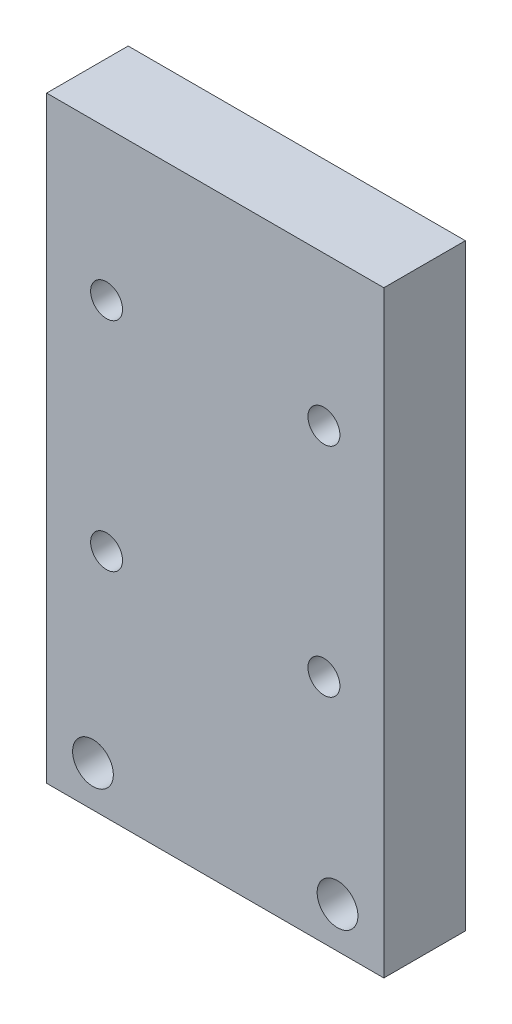
ISO-10303-21;
HEADER;
FILE_DESCRIPTION(('STEP AP214'),'2;1');
FILE_NAME('part.step','',(''),(''),'','','');
FILE_SCHEMA(('AUTOMOTIVE_DESIGN { 1 0 10303 214 1 1 1 1 }'));
ENDSEC;
DATA;
#1=APPLICATION_CONTEXT('core data for automotive mechanical design processes');
#2=APPLICATION_PROTOCOL_DEFINITION('international standard','automotive_design',2000,#1);
#3=PRODUCT_CONTEXT('',#1,'mechanical');
#4=PRODUCT('Part','Part','',(#3));
#5=PRODUCT_RELATED_PRODUCT_CATEGORY('part','',(#4));
#6=PRODUCT_DEFINITION_FORMATION('','',#4);
#7=PRODUCT_DEFINITION_CONTEXT('part definition',#1,'design');
#8=PRODUCT_DEFINITION('design','',#6,#7);
#9=PRODUCT_DEFINITION_SHAPE('','',#8);
#10=(LENGTH_UNIT() NAMED_UNIT(*) SI_UNIT(.MILLI.,.METRE.));
#11=(NAMED_UNIT(*) PLANE_ANGLE_UNIT() SI_UNIT($,.RADIAN.));
#12=(NAMED_UNIT(*) SI_UNIT($,.STERADIAN.) SOLID_ANGLE_UNIT());
#13=UNCERTAINTY_MEASURE_WITH_UNIT(LENGTH_MEASURE(1.E-05),#10,'distance_accuracy_value','');
#14=(GEOMETRIC_REPRESENTATION_CONTEXT(3) GLOBAL_UNCERTAINTY_ASSIGNED_CONTEXT((#13)) GLOBAL_UNIT_ASSIGNED_CONTEXT((#10,
#11,#12)) REPRESENTATION_CONTEXT('',''));
#15=CARTESIAN_POINT('',(0.,0.,0.));
#16=DIRECTION('',(0.,0.,1.));
#17=DIRECTION('',(1.,0.,0.));
#18=AXIS2_PLACEMENT_3D('',#15,#16,#17);
#19=CARTESIAN_POINT('',(0.,0.,6.));
#20=DIRECTION('',(0.,0.,1.));
#21=DIRECTION('',(1.,0.,0.));
#22=AXIS2_PLACEMENT_3D('',#19,#20,#21);
#23=PLANE('',#22);
#24=CARTESIAN_POINT('',(-43.6058720642566,15.1858972249347,6.));
#25=DIRECTION('',(0.,0.,1.));
#26=DIRECTION('',(1.,0.,0.));
#27=AXIS2_PLACEMENT_3D('',#24,#25,#26);
#28=CIRCLE('',#27,1.175);
#29=CARTESIAN_POINT('',(-42.4308720642566,15.1858972249347,6.));
#30=VERTEX_POINT('',#29);
#31=EDGE_CURVE('E142',#30,#30,#28,.T.);
#32=ORIENTED_EDGE('',*,*,#31,.F.);
#33=EDGE_LOOP('',(#32));
#34=FACE_BOUND('',#33,.T.);
#35=CARTESIAN_POINT('',(-59.6058720642566,15.1858972249347,6.));
#36=DIRECTION('',(0.,0.,1.));
#37=DIRECTION('',(1.,0.,0.));
#38=AXIS2_PLACEMENT_3D('',#35,#36,#37);
#39=CIRCLE('',#38,1.175);
#40=CARTESIAN_POINT('',(-58.4308720642566,15.1858972249347,6.));
#41=VERTEX_POINT('',#40);
#42=EDGE_CURVE('E136',#41,#41,#39,.T.);
#43=ORIENTED_EDGE('',*,*,#42,.F.);
#44=EDGE_LOOP('',(#43));
#45=FACE_BOUND('',#44,.T.);
#46=CARTESIAN_POINT('',(-59.6058720642566,31.1858972249347,6.));
#47=DIRECTION('',(0.,0.,1.));
#48=DIRECTION('',(1.,0.,0.));
#49=AXIS2_PLACEMENT_3D('',#46,#47,#48);
#50=CIRCLE('',#49,1.175);
#51=CARTESIAN_POINT('',(-58.4308720642566,31.1858972249347,6.));
#52=VERTEX_POINT('',#51);
#53=EDGE_CURVE('E130',#52,#52,#50,.T.);
#54=ORIENTED_EDGE('',*,*,#53,.F.);
#55=EDGE_LOOP('',(#54));
#56=FACE_BOUND('',#55,.T.);
#57=CARTESIAN_POINT('',(-43.6058720642566,31.1858972249347,6.));
#58=DIRECTION('',(0.,0.,1.));
#59=DIRECTION('',(1.,0.,0.));
#60=AXIS2_PLACEMENT_3D('',#57,#58,#59);
#61=CIRCLE('',#60,1.175);
#62=CARTESIAN_POINT('',(-42.4308720642566,31.1858972249347,6.));
#63=VERTEX_POINT('',#62);
#64=EDGE_CURVE('E124',#63,#63,#61,.T.);
#65=ORIENTED_EDGE('',*,*,#64,.F.);
#66=EDGE_LOOP('',(#65));
#67=FACE_BOUND('',#66,.T.);
#68=CARTESIAN_POINT('',(-60.6058720642566,1.18589722493471,6.));
#69=DIRECTION('',(0.,0.,1.));
#70=DIRECTION('',(1.,0.,0.));
#71=AXIS2_PLACEMENT_3D('',#68,#69,#70);
#72=CIRCLE('',#71,1.5);
#73=CARTESIAN_POINT('',(-59.1058720642565,1.18589722493471,6.));
#74=VERTEX_POINT('',#73);
#75=EDGE_CURVE('E100',#74,#74,#72,.T.);
#76=ORIENTED_EDGE('',*,*,#75,.F.);
#77=EDGE_LOOP('',(#76));
#78=FACE_BOUND('',#77,.T.);
#79=DIRECTION('',(0.,-1.,0.));
#80=VECTOR('',#79,1.);
#81=CARTESIAN_POINT('',(-64.0158720642566,42.1858972249347,6.));
#82=LINE('',#81,#80);
#83=CARTESIAN_POINT('',(-64.0158720642566,42.1858972249347,6.));
#84=VERTEX_POINT('',#83);
#85=CARTESIAN_POINT('',(-64.0158720642566,-1.81410277506529,6.));
#86=VERTEX_POINT('',#85);
#87=EDGE_CURVE('E85',#84,#86,#82,.T.);
#88=ORIENTED_EDGE('',*,*,#87,.T.);
#89=DIRECTION('',(1.,0.,0.));
#90=VECTOR('',#89,1.);
#91=CARTESIAN_POINT('',(-64.0158720642566,-1.81410277506529,6.));
#92=LINE('',#91,#90);
#93=CARTESIAN_POINT('',(-39.1958720642566,-1.81410277506529,6.));
#94=VERTEX_POINT('',#93);
#95=EDGE_CURVE('E80',#86,#94,#92,.T.);
#96=ORIENTED_EDGE('',*,*,#95,.T.);
#97=DIRECTION('',(0.,1.,0.));
#98=VECTOR('',#97,1.);
#99=CARTESIAN_POINT('',(-39.1958720642566,42.1858972249347,6.));
#100=LINE('',#99,#98);
#101=CARTESIAN_POINT('',(-39.1958720642566,42.1858972249347,6.));
#102=VERTEX_POINT('',#101);
#103=EDGE_CURVE('E83',#94,#102,#100,.T.);
#104=ORIENTED_EDGE('',*,*,#103,.T.);
#105=DIRECTION('',(-1.,0.,0.));
#106=VECTOR('',#105,1.);
#107=CARTESIAN_POINT('',(-64.0158720642566,42.1858972249347,6.));
#108=LINE('',#107,#106);
#109=EDGE_CURVE('E50',#102,#84,#108,.T.);
#110=ORIENTED_EDGE('',*,*,#109,.T.);
#111=EDGE_LOOP('',(#88,#96,#104,#110));
#112=FACE_BOUND('',#111,.T.);
#113=CARTESIAN_POINT('',(-42.6058720642565,1.18589722493471,6.));
#114=DIRECTION('',(0.,0.,1.));
#115=DIRECTION('',(1.,0.,0.));
#116=AXIS2_PLACEMENT_3D('',#113,#114,#115);
#117=CIRCLE('',#116,1.5);
#118=CARTESIAN_POINT('',(-41.1058720642565,1.18589722493471,6.));
#119=VERTEX_POINT('',#118);
#120=EDGE_CURVE('E115',#119,#119,#117,.T.);
#121=ORIENTED_EDGE('',*,*,#120,.F.);
#122=EDGE_LOOP('',(#121));
#123=FACE_BOUND('',#122,.T.);
#124=ADVANCED_FACE('F33',(#34,#45,#56,#67,#78,#112,#123),#23,.T.);
#125=CARTESIAN_POINT('',(0.,0.,0.));
#126=DIRECTION('',(0.,0.,1.));
#127=DIRECTION('',(1.,0.,0.));
#128=AXIS2_PLACEMENT_3D('',#125,#126,#127);
#129=PLANE('',#128);
#130=CARTESIAN_POINT('',(-43.6058720642566,15.1858972249347,0.));
#131=DIRECTION('',(0.,0.,1.));
#132=DIRECTION('',(1.,0.,0.));
#133=AXIS2_PLACEMENT_3D('',#130,#131,#132);
#134=CIRCLE('',#133,1.175);
#135=CARTESIAN_POINT('',(-42.4308720642566,15.1858972249347,0.));
#136=VERTEX_POINT('',#135);
#137=EDGE_CURVE('E139',#136,#136,#134,.T.);
#138=ORIENTED_EDGE('',*,*,#137,.T.);
#139=EDGE_LOOP('',(#138));
#140=FACE_BOUND('',#139,.T.);
#141=CARTESIAN_POINT('',(-59.6058720642566,15.1858972249347,0.));
#142=DIRECTION('',(0.,0.,1.));
#143=DIRECTION('',(1.,0.,0.));
#144=AXIS2_PLACEMENT_3D('',#141,#142,#143);
#145=CIRCLE('',#144,1.175);
#146=CARTESIAN_POINT('',(-58.4308720642566,15.1858972249347,0.));
#147=VERTEX_POINT('',#146);
#148=EDGE_CURVE('E133',#147,#147,#145,.T.);
#149=ORIENTED_EDGE('',*,*,#148,.T.);
#150=EDGE_LOOP('',(#149));
#151=FACE_BOUND('',#150,.T.);
#152=CARTESIAN_POINT('',(-59.6058720642566,31.1858972249347,0.));
#153=DIRECTION('',(0.,0.,1.));
#154=DIRECTION('',(1.,0.,0.));
#155=AXIS2_PLACEMENT_3D('',#152,#153,#154);
#156=CIRCLE('',#155,1.175);
#157=CARTESIAN_POINT('',(-58.4308720642566,31.1858972249347,0.));
#158=VERTEX_POINT('',#157);
#159=EDGE_CURVE('E127',#158,#158,#156,.T.);
#160=ORIENTED_EDGE('',*,*,#159,.T.);
#161=EDGE_LOOP('',(#160));
#162=FACE_BOUND('',#161,.T.);
#163=CARTESIAN_POINT('',(-43.6058720642566,31.1858972249347,0.));
#164=DIRECTION('',(0.,0.,1.));
#165=DIRECTION('',(1.,0.,0.));
#166=AXIS2_PLACEMENT_3D('',#163,#164,#165);
#167=CIRCLE('',#166,1.175);
#168=CARTESIAN_POINT('',(-42.4308720642566,31.1858972249347,0.));
#169=VERTEX_POINT('',#168);
#170=EDGE_CURVE('E121',#169,#169,#167,.T.);
#171=ORIENTED_EDGE('',*,*,#170,.T.);
#172=EDGE_LOOP('',(#171));
#173=FACE_BOUND('',#172,.T.);
#174=DIRECTION('',(0.,-1.,0.));
#175=VECTOR('',#174,1.);
#176=CARTESIAN_POINT('',(-64.0158720642566,42.1858972249347,0.));
#177=LINE('',#176,#175);
#178=CARTESIAN_POINT('',(-64.0158720642566,42.1858972249347,0.));
#179=VERTEX_POINT('',#178);
#180=CARTESIAN_POINT('',(-64.0158720642566,-1.81410277506529,0.));
#181=VERTEX_POINT('',#180);
#182=EDGE_CURVE('E97',#179,#181,#177,.T.);
#183=ORIENTED_EDGE('',*,*,#182,.F.);
#184=DIRECTION('',(-1.,0.,0.));
#185=VECTOR('',#184,1.);
#186=CARTESIAN_POINT('',(-64.0158720642566,42.1858972249347,0.));
#187=LINE('',#186,#185);
#188=CARTESIAN_POINT('',(-39.1958720642566,42.1858972249347,0.));
#189=VERTEX_POINT('',#188);
#190=EDGE_CURVE('E73',#189,#179,#187,.T.);
#191=ORIENTED_EDGE('',*,*,#190,.F.);
#192=DIRECTION('',(0.,1.,0.));
#193=VECTOR('',#192,1.);
#194=CARTESIAN_POINT('',(-39.1958720642566,42.1858972249347,0.));
#195=LINE('',#194,#193);
#196=CARTESIAN_POINT('',(-39.1958720642566,-1.81410277506529,0.));
#197=VERTEX_POINT('',#196);
#198=EDGE_CURVE('E67',#197,#189,#195,.T.);
#199=ORIENTED_EDGE('',*,*,#198,.F.);
#200=DIRECTION('',(1.,0.,0.));
#201=VECTOR('',#200,1.);
#202=CARTESIAN_POINT('',(-64.0158720642566,-1.81410277506529,0.));
#203=LINE('',#202,#201);
#204=EDGE_CURVE('E89',#181,#197,#203,.T.);
#205=ORIENTED_EDGE('',*,*,#204,.F.);
#206=EDGE_LOOP('',(#183,#191,#199,#205));
#207=FACE_BOUND('',#206,.T.);
#208=CARTESIAN_POINT('',(-60.6058720642566,1.18589722493471,0.));
#209=DIRECTION('',(0.,0.,1.));
#210=DIRECTION('',(1.,0.,0.));
#211=AXIS2_PLACEMENT_3D('',#208,#209,#210);
#212=CIRCLE('',#211,1.5);
#213=CARTESIAN_POINT('',(-59.1058720642565,1.18589722493471,0.));
#214=VERTEX_POINT('',#213);
#215=EDGE_CURVE('E112',#214,#214,#212,.T.);
#216=ORIENTED_EDGE('',*,*,#215,.T.);
#217=EDGE_LOOP('',(#216));
#218=FACE_BOUND('',#217,.T.);
#219=CARTESIAN_POINT('',(-42.6058720642565,1.18589722493471,0.));
#220=DIRECTION('',(0.,0.,1.));
#221=DIRECTION('',(1.,0.,0.));
#222=AXIS2_PLACEMENT_3D('',#219,#220,#221);
#223=CIRCLE('',#222,1.5);
#224=CARTESIAN_POINT('',(-41.1058720642565,1.18589722493471,0.));
#225=VERTEX_POINT('',#224);
#226=EDGE_CURVE('E118',#225,#225,#223,.T.);
#227=ORIENTED_EDGE('',*,*,#226,.T.);
#228=EDGE_LOOP('',(#227));
#229=FACE_BOUND('',#228,.T.);
#230=ADVANCED_FACE('F108',(#140,#151,#162,#173,#207,#218,#229),#129,.F.);
#231=CARTESIAN_POINT('',(-64.0158720642566,42.1858972249347,6.));
#232=DIRECTION('',(1.,0.,0.));
#233=DIRECTION('',(0.,1.,0.));
#234=AXIS2_PLACEMENT_3D('',#231,#232,#233);
#235=PLANE('',#234);
#236=ORIENTED_EDGE('',*,*,#182,.T.);
#237=DIRECTION('',(0.,0.,-1.));
#238=VECTOR('',#237,1.);
#239=CARTESIAN_POINT('',(-64.0158720642566,-1.81410277506529,6.));
#240=LINE('',#239,#238);
#241=EDGE_CURVE('E11',#86,#181,#240,.T.);
#242=ORIENTED_EDGE('',*,*,#241,.F.);
#243=ORIENTED_EDGE('',*,*,#87,.F.);
#244=DIRECTION('',(0.,0.,-1.));
#245=VECTOR('',#244,1.);
#246=CARTESIAN_POINT('',(-64.0158720642566,42.1858972249347,6.));
#247=LINE('',#246,#245);
#248=EDGE_CURVE('E93',#84,#179,#247,.T.);
#249=ORIENTED_EDGE('',*,*,#248,.T.);
#250=EDGE_LOOP('',(#236,#242,#243,#249));
#251=FACE_BOUND('',#250,.T.);
#252=ADVANCED_FACE('F35',(#251),#235,.F.);
#253=CARTESIAN_POINT('',(-64.0158720642566,-1.81410277506529,6.));
#254=DIRECTION('',(0.,1.,0.));
#255=DIRECTION('',(0.,0.,1.));
#256=AXIS2_PLACEMENT_3D('',#253,#254,#255);
#257=PLANE('',#256);
#258=ORIENTED_EDGE('',*,*,#204,.T.);
#259=DIRECTION('',(0.,0.,-1.));
#260=VECTOR('',#259,1.);
#261=CARTESIAN_POINT('',(-39.1958720642566,-1.81410277506529,6.));
#262=LINE('',#261,#260);
#263=EDGE_CURVE('E42',#94,#197,#262,.T.);
#264=ORIENTED_EDGE('',*,*,#263,.F.);
#265=ORIENTED_EDGE('',*,*,#95,.F.);
#266=ORIENTED_EDGE('',*,*,#241,.T.);
#267=EDGE_LOOP('',(#258,#264,#265,#266));
#268=FACE_BOUND('',#267,.T.);
#269=ADVANCED_FACE('F88',(#268),#257,.F.);
#270=CARTESIAN_POINT('',(-39.1958720642566,42.1858972249347,6.));
#271=DIRECTION('',(-1.,0.,0.));
#272=DIRECTION('',(0.,-1.,0.));
#273=AXIS2_PLACEMENT_3D('',#270,#271,#272);
#274=PLANE('',#273);
#275=ORIENTED_EDGE('',*,*,#198,.T.);
#276=DIRECTION('',(0.,0.,-1.));
#277=VECTOR('',#276,1.);
#278=CARTESIAN_POINT('',(-39.1958720642566,42.1858972249347,6.));
#279=LINE('',#278,#277);
#280=EDGE_CURVE('E90',#102,#189,#279,.T.);
#281=ORIENTED_EDGE('',*,*,#280,.F.);
#282=ORIENTED_EDGE('',*,*,#103,.F.);
#283=ORIENTED_EDGE('',*,*,#263,.T.);
#284=EDGE_LOOP('',(#275,#281,#282,#283));
#285=FACE_BOUND('',#284,.T.);
#286=ADVANCED_FACE('F91',(#285),#274,.F.);
#287=CARTESIAN_POINT('',(-64.0158720642566,42.1858972249347,6.));
#288=DIRECTION('',(0.,-1.,0.));
#289=DIRECTION('',(0.,0.,-1.));
#290=AXIS2_PLACEMENT_3D('',#287,#288,#289);
#291=PLANE('',#290);
#292=ORIENTED_EDGE('',*,*,#190,.T.);
#293=ORIENTED_EDGE('',*,*,#248,.F.);
#294=ORIENTED_EDGE('',*,*,#109,.F.);
#295=ORIENTED_EDGE('',*,*,#280,.T.);
#296=EDGE_LOOP('',(#292,#293,#294,#295));
#297=FACE_BOUND('',#296,.T.);
#298=ADVANCED_FACE('F105',(#297),#291,.F.);
#299=CARTESIAN_POINT('',(-60.6058720642566,1.18589722493471,6.));
#300=DIRECTION('',(0.,0.,-1.));
#301=DIRECTION('',(-1.,0.,0.));
#302=AXIS2_PLACEMENT_3D('',#299,#300,#301);
#303=CYLINDRICAL_SURFACE('',#302,1.5);
#304=ORIENTED_EDGE('',*,*,#75,.T.);
#305=EDGE_LOOP('',(#304));
#306=FACE_BOUND('',#305,.T.);
#307=ORIENTED_EDGE('',*,*,#215,.F.);
#308=EDGE_LOOP('',(#307));
#309=FACE_BOUND('',#308,.T.);
#310=ADVANCED_FACE('F168',(#306,#309),#303,.F.);
#311=CARTESIAN_POINT('',(-42.6058720642565,1.18589722493471,6.));
#312=DIRECTION('',(0.,0.,-1.));
#313=DIRECTION('',(-1.,0.,0.));
#314=AXIS2_PLACEMENT_3D('',#311,#312,#313);
#315=CYLINDRICAL_SURFACE('',#314,1.5);
#316=ORIENTED_EDGE('',*,*,#120,.T.);
#317=EDGE_LOOP('',(#316));
#318=FACE_BOUND('',#317,.T.);
#319=ORIENTED_EDGE('',*,*,#226,.F.);
#320=EDGE_LOOP('',(#319));
#321=FACE_BOUND('',#320,.T.);
#322=ADVANCED_FACE('F171',(#318,#321),#315,.F.);
#323=CARTESIAN_POINT('',(-43.6058720642566,31.1858972249347,0.));
#324=DIRECTION('',(0.,0.,1.));
#325=DIRECTION('',(1.,0.,0.));
#326=AXIS2_PLACEMENT_3D('',#323,#324,#325);
#327=CYLINDRICAL_SURFACE('',#326,1.175);
#328=ORIENTED_EDGE('',*,*,#170,.F.);
#329=EDGE_LOOP('',(#328));
#330=FACE_BOUND('',#329,.T.);
#331=ORIENTED_EDGE('',*,*,#64,.T.);
#332=EDGE_LOOP('',(#331));
#333=FACE_BOUND('',#332,.T.);
#334=ADVANCED_FACE('F180',(#330,#333),#327,.F.);
#335=CARTESIAN_POINT('',(-59.6058720642566,31.1858972249347,0.));
#336=DIRECTION('',(0.,0.,1.));
#337=DIRECTION('',(1.,0.,0.));
#338=AXIS2_PLACEMENT_3D('',#335,#336,#337);
#339=CYLINDRICAL_SURFACE('',#338,1.175);
#340=ORIENTED_EDGE('',*,*,#159,.F.);
#341=EDGE_LOOP('',(#340));
#342=FACE_BOUND('',#341,.T.);
#343=ORIENTED_EDGE('',*,*,#53,.T.);
#344=EDGE_LOOP('',(#343));
#345=FACE_BOUND('',#344,.T.);
#346=ADVANCED_FACE('F186',(#342,#345),#339,.F.);
#347=CARTESIAN_POINT('',(-59.6058720642566,15.1858972249347,0.));
#348=DIRECTION('',(0.,0.,1.));
#349=DIRECTION('',(1.,0.,0.));
#350=AXIS2_PLACEMENT_3D('',#347,#348,#349);
#351=CYLINDRICAL_SURFACE('',#350,1.175);
#352=ORIENTED_EDGE('',*,*,#148,.F.);
#353=EDGE_LOOP('',(#352));
#354=FACE_BOUND('',#353,.T.);
#355=ORIENTED_EDGE('',*,*,#42,.T.);
#356=EDGE_LOOP('',(#355));
#357=FACE_BOUND('',#356,.T.);
#358=ADVANCED_FACE('F153',(#354,#357),#351,.F.);
#359=CARTESIAN_POINT('',(-43.6058720642566,15.1858972249347,0.));
#360=DIRECTION('',(0.,0.,1.));
#361=DIRECTION('',(1.,0.,0.));
#362=AXIS2_PLACEMENT_3D('',#359,#360,#361);
#363=CYLINDRICAL_SURFACE('',#362,1.175);
#364=ORIENTED_EDGE('',*,*,#137,.F.);
#365=EDGE_LOOP('',(#364));
#366=FACE_BOUND('',#365,.T.);
#367=ORIENTED_EDGE('',*,*,#31,.T.);
#368=EDGE_LOOP('',(#367));
#369=FACE_BOUND('',#368,.T.);
#370=ADVANCED_FACE('F150',(#366,#369),#363,.F.);
#371=CLOSED_SHELL('',(#124,#230,#252,#269,#286,#298,#310,#322,#334,#346,#358,#370));
#372=MANIFOLD_SOLID_BREP('B2',#371);
#373=ADVANCED_BREP_SHAPE_REPRESENTATION('',(#18,#372),#14);
#374=SHAPE_DEFINITION_REPRESENTATION(#9,#373);
ENDSEC;
END-ISO-10303-21;
